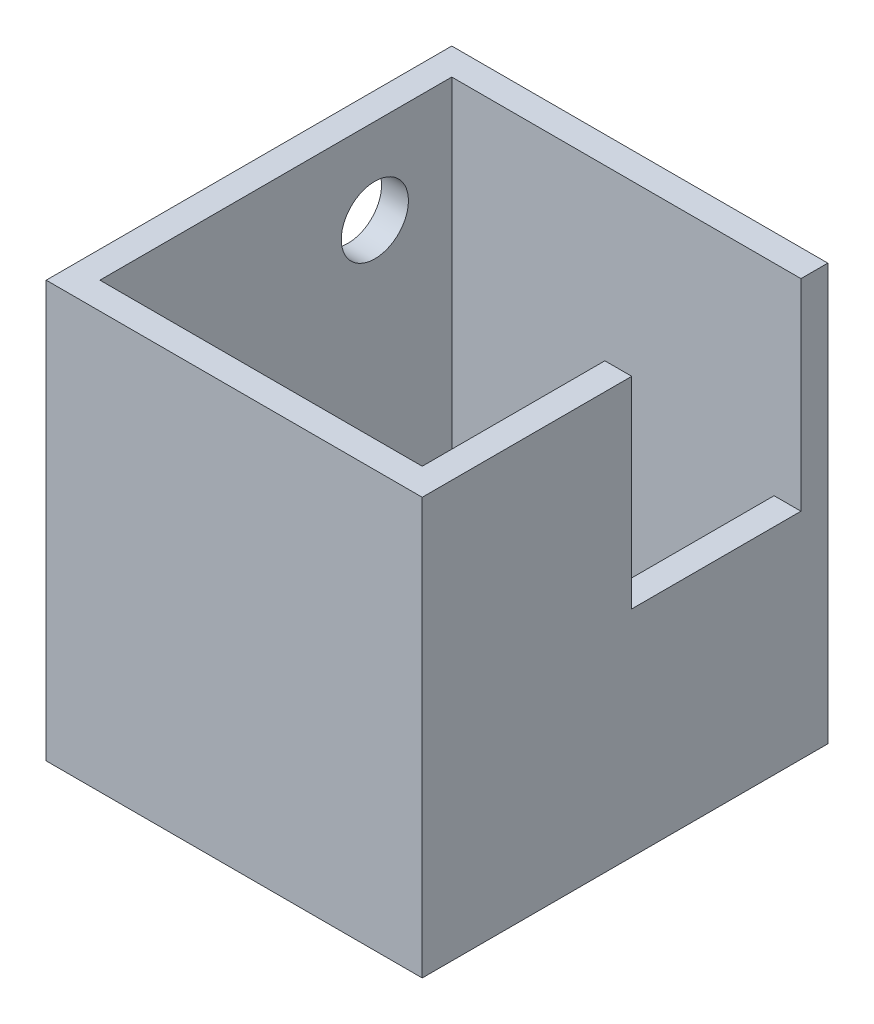
ISO-10303-21;
HEADER;
FILE_DESCRIPTION(('STEP AP214'),'2;1');
FILE_NAME('part.step','',(''),(''),'','','');
FILE_SCHEMA(('AUTOMOTIVE_DESIGN { 1 0 10303 214 1 1 1 1 }'));
ENDSEC;
DATA;
#1=APPLICATION_CONTEXT('core data for automotive mechanical design processes');
#2=APPLICATION_PROTOCOL_DEFINITION('international standard','automotive_design',2000,#1);
#3=PRODUCT_CONTEXT('',#1,'mechanical');
#4=PRODUCT('Part','Part','',(#3));
#5=PRODUCT_RELATED_PRODUCT_CATEGORY('part','',(#4));
#6=PRODUCT_DEFINITION_FORMATION('','',#4);
#7=PRODUCT_DEFINITION_CONTEXT('part definition',#1,'design');
#8=PRODUCT_DEFINITION('design','',#6,#7);
#9=PRODUCT_DEFINITION_SHAPE('','',#8);
#10=(LENGTH_UNIT() NAMED_UNIT(*) SI_UNIT(.MILLI.,.METRE.));
#11=(NAMED_UNIT(*) PLANE_ANGLE_UNIT() SI_UNIT($,.RADIAN.));
#12=(NAMED_UNIT(*) SI_UNIT($,.STERADIAN.) SOLID_ANGLE_UNIT());
#13=UNCERTAINTY_MEASURE_WITH_UNIT(LENGTH_MEASURE(1.E-05),#10,'distance_accuracy_value','');
#14=(GEOMETRIC_REPRESENTATION_CONTEXT(3) GLOBAL_UNCERTAINTY_ASSIGNED_CONTEXT((#13)) GLOBAL_UNIT_ASSIGNED_CONTEXT((#10,
#11,#12)) REPRESENTATION_CONTEXT('',''));
#15=CARTESIAN_POINT('',(0.,0.,0.));
#16=DIRECTION('',(0.,0.,1.));
#17=DIRECTION('',(1.,0.,0.));
#18=AXIS2_PLACEMENT_3D('',#15,#16,#17);
#19=CARTESIAN_POINT('',(2.,0.,30.2));
#20=DIRECTION('',(1.,0.,0.));
#21=DIRECTION('',(0.,0.,-1.));
#22=AXIS2_PLACEMENT_3D('',#19,#20,#21);
#23=PLANE('',#22);
#24=CARTESIAN_POINT('',(2.,24.64,7.72826581115035));
#25=DIRECTION('',(1.,0.,0.));
#26=DIRECTION('',(0.,0.,-1.));
#27=AXIS2_PLACEMENT_3D('',#24,#25,#26);
#28=CIRCLE('',#27,2.5);
#29=CARTESIAN_POINT('',(2.,24.64,5.22826581115035));
#30=VERTEX_POINT('',#29);
#31=EDGE_CURVE('E323',#30,#30,#28,.F.);
#32=ORIENTED_EDGE('',*,*,#31,.T.);
#33=EDGE_LOOP('',(#32));
#34=FACE_BOUND('',#33,.T.);
#35=DIRECTION('',(0.,0.,-1.));
#36=VECTOR('',#35,1.);
#37=CARTESIAN_POINT('',(2.,2.,30.2));
#38=LINE('',#37,#36);
#39=CARTESIAN_POINT('',(2.,2.,15.6));
#40=VERTEX_POINT('',#39);
#41=CARTESIAN_POINT('',(2.,2.,14.6));
#42=VERTEX_POINT('',#41);
#43=EDGE_CURVE('E223',#40,#42,#38,.T.);
#44=ORIENTED_EDGE('',*,*,#43,.T.);
#45=DIRECTION('',(0.,-1.,0.));
#46=VECTOR('',#45,1.);
#47=CARTESIAN_POINT('',(2.,3.5,14.6));
#48=LINE('',#47,#46);
#49=CARTESIAN_POINT('',(2.,3.5,14.6));
#50=VERTEX_POINT('',#49);
#51=EDGE_CURVE('E52',#50,#42,#48,.T.);
#52=ORIENTED_EDGE('',*,*,#51,.F.);
#53=DIRECTION('',(0.,0.,1.));
#54=VECTOR('',#53,1.);
#55=CARTESIAN_POINT('',(2.,3.5,14.6));
#56=LINE('',#55,#54);
#57=CARTESIAN_POINT('',(2.,3.5,2.));
#58=VERTEX_POINT('',#57);
#59=EDGE_CURVE('E164',#58,#50,#56,.T.);
#60=ORIENTED_EDGE('',*,*,#59,.F.);
#61=DIRECTION('',(0.,-1.,0.));
#62=VECTOR('',#61,1.);
#63=CARTESIAN_POINT('',(2.,0.,2.));
#64=LINE('',#63,#62);
#65=CARTESIAN_POINT('',(2.,31.,2.));
#66=VERTEX_POINT('',#65);
#67=EDGE_CURVE('E152',#66,#58,#64,.T.);
#68=ORIENTED_EDGE('',*,*,#67,.F.);
#69=DIRECTION('',(0.,0.,-1.));
#70=VECTOR('',#69,1.);
#71=CARTESIAN_POINT('',(2.,31.,30.2));
#72=LINE('',#71,#70);
#73=CARTESIAN_POINT('',(2.,31.,28.2));
#74=VERTEX_POINT('',#73);
#75=EDGE_CURVE('E238',#74,#66,#72,.T.);
#76=ORIENTED_EDGE('',*,*,#75,.F.);
#77=DIRECTION('',(0.,-1.,0.));
#78=VECTOR('',#77,1.);
#79=CARTESIAN_POINT('',(2.,0.,28.2));
#80=LINE('',#79,#78);
#81=CARTESIAN_POINT('',(2.,0.,28.2));
#82=VERTEX_POINT('',#81);
#83=EDGE_CURVE('E227',#74,#82,#80,.T.);
#84=ORIENTED_EDGE('',*,*,#83,.T.);
#85=DIRECTION('',(0.,0.,-1.));
#86=VECTOR('',#85,1.);
#87=CARTESIAN_POINT('',(2.,0.,28.2));
#88=LINE('',#87,#86);
#89=CARTESIAN_POINT('',(2.,0.,15.6));
#90=VERTEX_POINT('',#89);
#91=EDGE_CURVE('E186',#82,#90,#88,.T.);
#92=ORIENTED_EDGE('',*,*,#91,.T.);
#93=DIRECTION('',(0.,1.,0.));
#94=VECTOR('',#93,1.);
#95=CARTESIAN_POINT('',(2.,-0.00100000000000013,15.6));
#96=LINE('',#95,#94);
#97=EDGE_CURVE('E195',#90,#40,#96,.T.);
#98=ORIENTED_EDGE('',*,*,#97,.T.);
#99=EDGE_LOOP('',(#44,#52,#60,#68,#76,#84,#92,#98));
#100=FACE_BOUND('',#99,.T.);
#101=ADVANCED_FACE('F37',(#34,#100),#23,.T.);
#102=CARTESIAN_POINT('',(0.,2.,30.2));
#103=DIRECTION('',(0.,1.,0.));
#104=DIRECTION('',(0.,0.,1.));
#105=AXIS2_PLACEMENT_3D('',#102,#103,#104);
#106=PLANE('',#105);
#107=DIRECTION('',(0.,0.,-1.));
#108=VECTOR('',#107,1.);
#109=CARTESIAN_POINT('',(26.,2.,30.2));
#110=LINE('',#109,#108);
#111=CARTESIAN_POINT('',(26.,2.,28.2));
#112=VERTEX_POINT('',#111);
#113=CARTESIAN_POINT('',(26.,2.,14.6));
#114=VERTEX_POINT('',#113);
#115=EDGE_CURVE('E226',#112,#114,#110,.T.);
#116=ORIENTED_EDGE('',*,*,#115,.T.);
#117=DIRECTION('',(1.,0.,0.));
#118=VECTOR('',#117,1.);
#119=CARTESIAN_POINT('',(2.,2.,14.6));
#120=LINE('',#119,#118);
#121=EDGE_CURVE('E60',#42,#114,#120,.T.);
#122=ORIENTED_EDGE('',*,*,#121,.F.);
#123=ORIENTED_EDGE('',*,*,#43,.F.);
#124=DIRECTION('',(-1.,0.,0.));
#125=VECTOR('',#124,1.);
#126=CARTESIAN_POINT('',(2.,2.,15.6));
#127=LINE('',#126,#125);
#128=CARTESIAN_POINT('',(17.,2.,15.6));
#129=VERTEX_POINT('',#128);
#130=EDGE_CURVE('E191',#129,#40,#127,.T.);
#131=ORIENTED_EDGE('',*,*,#130,.F.);
#132=DIRECTION('',(0.,0.,-1.));
#133=VECTOR('',#132,1.);
#134=CARTESIAN_POINT('',(17.,2.,28.2));
#135=LINE('',#134,#133);
#136=CARTESIAN_POINT('',(17.,2.,28.2));
#137=VERTEX_POINT('',#136);
#138=EDGE_CURVE('E189',#137,#129,#135,.T.);
#139=ORIENTED_EDGE('',*,*,#138,.F.);
#140=DIRECTION('',(1.,0.,0.));
#141=VECTOR('',#140,1.);
#142=CARTESIAN_POINT('',(0.,2.,28.2));
#143=LINE('',#142,#141);
#144=EDGE_CURVE('E229',#137,#112,#143,.T.);
#145=ORIENTED_EDGE('',*,*,#144,.T.);
#146=EDGE_LOOP('',(#116,#122,#123,#131,#139,#145));
#147=FACE_BOUND('',#146,.T.);
#148=ADVANCED_FACE('F318',(#147),#106,.T.);
#149=CARTESIAN_POINT('',(26.,0.,30.2));
#150=DIRECTION('',(-1.,0.,0.));
#151=DIRECTION('',(0.,0.,1.));
#152=AXIS2_PLACEMENT_3D('',#149,#150,#151);
#153=PLANE('',#152);
#154=DIRECTION('',(0.,0.,-1.));
#155=VECTOR('',#154,1.);
#156=CARTESIAN_POINT('',(26.,3.5,14.6));
#157=LINE('',#156,#155);
#158=CARTESIAN_POINT('',(26.,3.5,14.6));
#159=VERTEX_POINT('',#158);
#160=CARTESIAN_POINT('',(26.,3.5,2.));
#161=VERTEX_POINT('',#160);
#162=EDGE_CURVE('E171',#159,#161,#157,.T.);
#163=ORIENTED_EDGE('',*,*,#162,.F.);
#164=DIRECTION('',(0.,-1.,0.));
#165=VECTOR('',#164,1.);
#166=CARTESIAN_POINT('',(26.,3.5,14.6));
#167=LINE('',#166,#165);
#168=EDGE_CURVE('E172',#159,#114,#167,.T.);
#169=ORIENTED_EDGE('',*,*,#168,.T.);
#170=ORIENTED_EDGE('',*,*,#115,.F.);
#171=DIRECTION('',(0.,1.,0.));
#172=VECTOR('',#171,1.);
#173=CARTESIAN_POINT('',(26.,0.,28.2));
#174=LINE('',#173,#172);
#175=CARTESIAN_POINT('',(26.,31.,28.2));
#176=VERTEX_POINT('',#175);
#177=EDGE_CURVE('E233',#112,#176,#174,.T.);
#178=ORIENTED_EDGE('',*,*,#177,.T.);
#179=DIRECTION('',(0.,0.,-1.));
#180=VECTOR('',#179,1.);
#181=CARTESIAN_POINT('',(26.,31.,30.2));
#182=LINE('',#181,#180);
#183=CARTESIAN_POINT('',(26.,31.,14.6));
#184=VERTEX_POINT('',#183);
#185=EDGE_CURVE('E231',#176,#184,#182,.T.);
#186=ORIENTED_EDGE('',*,*,#185,.T.);
#187=DIRECTION('',(0.,-1.,0.));
#188=VECTOR('',#187,1.);
#189=CARTESIAN_POINT('',(26.,31.,14.6));
#190=LINE('',#189,#188);
#191=CARTESIAN_POINT('',(26.,16.,14.6));
#192=VERTEX_POINT('',#191);
#193=EDGE_CURVE('E204',#184,#192,#190,.T.);
#194=ORIENTED_EDGE('',*,*,#193,.T.);
#195=DIRECTION('',(0.,0.,-1.));
#196=VECTOR('',#195,1.);
#197=CARTESIAN_POINT('',(26.,16.,2.));
#198=LINE('',#197,#196);
#199=CARTESIAN_POINT('',(26.,16.,2.));
#200=VERTEX_POINT('',#199);
#201=EDGE_CURVE('E207',#192,#200,#198,.T.);
#202=ORIENTED_EDGE('',*,*,#201,.T.);
#203=DIRECTION('',(0.,1.,0.));
#204=VECTOR('',#203,1.);
#205=CARTESIAN_POINT('',(26.,0.,2.));
#206=LINE('',#205,#204);
#207=EDGE_CURVE('E160',#161,#200,#206,.T.);
#208=ORIENTED_EDGE('',*,*,#207,.F.);
#209=EDGE_LOOP('',(#163,#169,#170,#178,#186,#194,#202,#208));
#210=FACE_BOUND('',#209,.T.);
#211=ADVANCED_FACE('F300',(#210),#153,.T.);
#212=CARTESIAN_POINT('',(0.,0.,2.));
#213=DIRECTION('',(0.,0.,-1.));
#214=DIRECTION('',(-1.,0.,0.));
#215=AXIS2_PLACEMENT_3D('',#212,#213,#214);
#216=PLANE('',#215);
#217=DIRECTION('',(-1.,0.,0.));
#218=VECTOR('',#217,1.);
#219=CARTESIAN_POINT('',(2.,3.5,2.));
#220=LINE('',#219,#218);
#221=EDGE_CURVE('E155',#161,#58,#220,.T.);
#222=ORIENTED_EDGE('',*,*,#221,.F.);
#223=ORIENTED_EDGE('',*,*,#207,.T.);
#224=DIRECTION('',(1.,0.,0.));
#225=VECTOR('',#224,1.);
#226=CARTESIAN_POINT('',(-0.001000000000001,16.,2.));
#227=LINE('',#226,#225);
#228=CARTESIAN_POINT('',(28.,16.,2.));
#229=VERTEX_POINT('',#228);
#230=EDGE_CURVE('E161',#200,#229,#227,.T.);
#231=ORIENTED_EDGE('',*,*,#230,.T.);
#232=DIRECTION('',(0.,1.,0.));
#233=VECTOR('',#232,1.);
#234=CARTESIAN_POINT('',(28.,31.,2.));
#235=LINE('',#234,#233);
#236=CARTESIAN_POINT('',(28.,31.,2.));
#237=VERTEX_POINT('',#236);
#238=EDGE_CURVE('E210',#229,#237,#235,.T.);
#239=ORIENTED_EDGE('',*,*,#238,.T.);
#240=DIRECTION('',(-1.,0.,0.));
#241=VECTOR('',#240,1.);
#242=CARTESIAN_POINT('',(0.,31.,2.));
#243=LINE('',#242,#241);
#244=EDGE_CURVE('E158',#237,#66,#243,.T.);
#245=ORIENTED_EDGE('',*,*,#244,.T.);
#246=ORIENTED_EDGE('',*,*,#67,.T.);
#247=EDGE_LOOP('',(#222,#223,#231,#239,#245,#246));
#248=FACE_BOUND('',#247,.T.);
#249=ADVANCED_FACE('F153',(#248),#216,.F.);
#250=CARTESIAN_POINT('',(0.,31.,30.2));
#251=DIRECTION('',(0.,-1.,0.));
#252=DIRECTION('',(0.,0.,-1.));
#253=AXIS2_PLACEMENT_3D('',#250,#251,#252);
#254=PLANE('',#253);
#255=DIRECTION('',(0.,0.,-1.));
#256=VECTOR('',#255,1.);
#257=CARTESIAN_POINT('',(28.,31.,30.2));
#258=LINE('',#257,#256);
#259=CARTESIAN_POINT('',(28.,31.,30.2));
#260=VERTEX_POINT('',#259);
#261=CARTESIAN_POINT('',(28.,31.,14.6));
#262=VERTEX_POINT('',#261);
#263=EDGE_CURVE('E267',#260,#262,#258,.T.);
#264=ORIENTED_EDGE('',*,*,#263,.T.);
#265=DIRECTION('',(1.,0.,0.));
#266=VECTOR('',#265,1.);
#267=CARTESIAN_POINT('',(-0.001000000000001,31.,14.6));
#268=LINE('',#267,#266);
#269=EDGE_CURVE('E218',#184,#262,#268,.T.);
#270=ORIENTED_EDGE('',*,*,#269,.F.);
#271=ORIENTED_EDGE('',*,*,#185,.F.);
#272=DIRECTION('',(-1.,0.,0.));
#273=VECTOR('',#272,1.);
#274=CARTESIAN_POINT('',(0.,31.,28.2));
#275=LINE('',#274,#273);
#276=EDGE_CURVE('E237',#176,#74,#275,.T.);
#277=ORIENTED_EDGE('',*,*,#276,.T.);
#278=ORIENTED_EDGE('',*,*,#75,.T.);
#279=ORIENTED_EDGE('',*,*,#244,.F.);
#280=CARTESIAN_POINT('',(28.,31.,0.));
#281=VERTEX_POINT('',#280);
#282=EDGE_CURVE('E266',#237,#281,#258,.T.);
#283=ORIENTED_EDGE('',*,*,#282,.T.);
#284=DIRECTION('',(-1.,0.,0.));
#285=VECTOR('',#284,1.);
#286=CARTESIAN_POINT('',(0.,31.,0.));
#287=LINE('',#286,#285);
#288=CARTESIAN_POINT('',(0.,31.,0.));
#289=VERTEX_POINT('',#288);
#290=EDGE_CURVE('E249',#281,#289,#287,.T.);
#291=ORIENTED_EDGE('',*,*,#290,.T.);
#292=DIRECTION('',(0.,0.,-1.));
#293=VECTOR('',#292,1.);
#294=CARTESIAN_POINT('',(0.,31.,30.2));
#295=LINE('',#294,#293);
#296=CARTESIAN_POINT('',(0.,31.,30.2));
#297=VERTEX_POINT('',#296);
#298=EDGE_CURVE('E255',#297,#289,#295,.T.);
#299=ORIENTED_EDGE('',*,*,#298,.F.);
#300=DIRECTION('',(-1.,0.,0.));
#301=VECTOR('',#300,1.);
#302=CARTESIAN_POINT('',(0.,31.,30.2));
#303=LINE('',#302,#301);
#304=EDGE_CURVE('E253',#260,#297,#303,.T.);
#305=ORIENTED_EDGE('',*,*,#304,.F.);
#306=EDGE_LOOP('',(#264,#270,#271,#277,#278,#279,#283,#291,#299,#305));
#307=FACE_BOUND('',#306,.T.);
#308=ADVANCED_FACE('F285',(#307),#254,.F.);
#309=CARTESIAN_POINT('',(0.,0.,30.2));
#310=DIRECTION('',(1.,0.,0.));
#311=DIRECTION('',(0.,0.,-1.));
#312=AXIS2_PLACEMENT_3D('',#309,#310,#311);
#313=PLANE('',#312);
#314=CARTESIAN_POINT('',(0.,24.64,7.72826581115035));
#315=DIRECTION('',(-1.,0.,0.));
#316=DIRECTION('',(0.,0.,1.));
#317=AXIS2_PLACEMENT_3D('',#314,#315,#316);
#318=CIRCLE('',#317,2.5);
#319=CARTESIAN_POINT('',(0.,24.64,10.2282658111504));
#320=VERTEX_POINT('',#319);
#321=EDGE_CURVE('E178',#320,#320,#318,.T.);
#322=ORIENTED_EDGE('',*,*,#321,.F.);
#323=EDGE_LOOP('',(#322));
#324=FACE_BOUND('',#323,.T.);
#325=DIRECTION('',(0.,-1.,0.));
#326=VECTOR('',#325,1.);
#327=CARTESIAN_POINT('',(0.,0.,0.));
#328=LINE('',#327,#326);
#329=CARTESIAN_POINT('',(0.,0.,0.));
#330=VERTEX_POINT('',#329);
#331=EDGE_CURVE('E225',#289,#330,#328,.T.);
#332=ORIENTED_EDGE('',*,*,#331,.T.);
#333=DIRECTION('',(0.,0.,-1.));
#334=VECTOR('',#333,1.);
#335=CARTESIAN_POINT('',(0.,0.,30.2));
#336=LINE('',#335,#334);
#337=CARTESIAN_POINT('',(0.,0.,30.2));
#338=VERTEX_POINT('',#337);
#339=EDGE_CURVE('E11',#338,#330,#336,.T.);
#340=ORIENTED_EDGE('',*,*,#339,.F.);
#341=DIRECTION('',(0.,-1.,0.));
#342=VECTOR('',#341,1.);
#343=CARTESIAN_POINT('',(0.,0.,30.2));
#344=LINE('',#343,#342);
#345=EDGE_CURVE('E245',#297,#338,#344,.T.);
#346=ORIENTED_EDGE('',*,*,#345,.F.);
#347=ORIENTED_EDGE('',*,*,#298,.T.);
#348=EDGE_LOOP('',(#332,#340,#346,#347));
#349=FACE_BOUND('',#348,.T.);
#350=ADVANCED_FACE('F39',(#324,#349),#313,.F.);
#351=CARTESIAN_POINT('',(0.,0.,30.2));
#352=DIRECTION('',(0.,1.,0.));
#353=DIRECTION('',(0.,0.,1.));
#354=AXIS2_PLACEMENT_3D('',#351,#352,#353);
#355=PLANE('',#354);
#356=DIRECTION('',(1.,0.,0.));
#357=VECTOR('',#356,1.);
#358=CARTESIAN_POINT('',(2.,0.,15.6));
#359=LINE('',#358,#357);
#360=CARTESIAN_POINT('',(17.,0.,15.6));
#361=VERTEX_POINT('',#360);
#362=EDGE_CURVE('E183',#90,#361,#359,.T.);
#363=ORIENTED_EDGE('',*,*,#362,.F.);
#364=ORIENTED_EDGE('',*,*,#91,.F.);
#365=DIRECTION('',(-1.,0.,0.));
#366=VECTOR('',#365,1.);
#367=CARTESIAN_POINT('',(2.,0.,28.2));
#368=LINE('',#367,#366);
#369=CARTESIAN_POINT('',(17.,0.,28.2));
#370=VERTEX_POINT('',#369);
#371=EDGE_CURVE('E197',#370,#82,#368,.T.);
#372=ORIENTED_EDGE('',*,*,#371,.F.);
#373=DIRECTION('',(0.,0.,1.));
#374=VECTOR('',#373,1.);
#375=CARTESIAN_POINT('',(17.,0.,28.2));
#376=LINE('',#375,#374);
#377=EDGE_CURVE('E181',#361,#370,#376,.T.);
#378=ORIENTED_EDGE('',*,*,#377,.F.);
#379=EDGE_LOOP('',(#363,#364,#372,#378));
#380=FACE_BOUND('',#379,.T.);
#381=DIRECTION('',(1.,0.,0.));
#382=VECTOR('',#381,1.);
#383=CARTESIAN_POINT('',(0.,0.,0.));
#384=LINE('',#383,#382);
#385=CARTESIAN_POINT('',(28.,0.,0.));
#386=VERTEX_POINT('',#385);
#387=EDGE_CURVE('E258',#330,#386,#384,.T.);
#388=ORIENTED_EDGE('',*,*,#387,.T.);
#389=DIRECTION('',(0.,0.,-1.));
#390=VECTOR('',#389,1.);
#391=CARTESIAN_POINT('',(28.,0.,30.2));
#392=LINE('',#391,#390);
#393=CARTESIAN_POINT('',(28.,0.,30.2));
#394=VERTEX_POINT('',#393);
#395=EDGE_CURVE('E45',#394,#386,#392,.T.);
#396=ORIENTED_EDGE('',*,*,#395,.F.);
#397=DIRECTION('',(1.,0.,0.));
#398=VECTOR('',#397,1.);
#399=CARTESIAN_POINT('',(0.,0.,30.2));
#400=LINE('',#399,#398);
#401=EDGE_CURVE('E248',#338,#394,#400,.T.);
#402=ORIENTED_EDGE('',*,*,#401,.F.);
#403=ORIENTED_EDGE('',*,*,#339,.T.);
#404=EDGE_LOOP('',(#388,#396,#402,#403));
#405=FACE_BOUND('',#404,.T.);
#406=ADVANCED_FACE('F313',(#380,#405),#355,.F.);
#407=CARTESIAN_POINT('',(28.,0.,30.2));
#408=DIRECTION('',(-1.,0.,0.));
#409=DIRECTION('',(0.,0.,1.));
#410=AXIS2_PLACEMENT_3D('',#407,#408,#409);
#411=PLANE('',#410);
#412=DIRECTION('',(0.,0.,-1.));
#413=VECTOR('',#412,1.);
#414=CARTESIAN_POINT('',(28.,16.,2.));
#415=LINE('',#414,#413);
#416=CARTESIAN_POINT('',(28.,16.,14.6));
#417=VERTEX_POINT('',#416);
#418=EDGE_CURVE('E215',#417,#229,#415,.T.);
#419=ORIENTED_EDGE('',*,*,#418,.F.);
#420=DIRECTION('',(0.,-1.,0.));
#421=VECTOR('',#420,1.);
#422=CARTESIAN_POINT('',(28.,31.,14.6));
#423=LINE('',#422,#421);
#424=EDGE_CURVE('E212',#262,#417,#423,.T.);
#425=ORIENTED_EDGE('',*,*,#424,.F.);
#426=ORIENTED_EDGE('',*,*,#263,.F.);
#427=DIRECTION('',(0.,1.,0.));
#428=VECTOR('',#427,1.);
#429=CARTESIAN_POINT('',(28.,0.,30.2));
#430=LINE('',#429,#428);
#431=EDGE_CURVE('E251',#394,#260,#430,.T.);
#432=ORIENTED_EDGE('',*,*,#431,.F.);
#433=ORIENTED_EDGE('',*,*,#395,.T.);
#434=DIRECTION('',(0.,1.,0.));
#435=VECTOR('',#434,1.);
#436=CARTESIAN_POINT('',(28.,0.,0.));
#437=LINE('',#436,#435);
#438=EDGE_CURVE('E260',#386,#281,#437,.T.);
#439=ORIENTED_EDGE('',*,*,#438,.T.);
#440=ORIENTED_EDGE('',*,*,#282,.F.);
#441=ORIENTED_EDGE('',*,*,#238,.F.);
#442=EDGE_LOOP('',(#419,#425,#426,#432,#433,#439,#440,#441));
#443=FACE_BOUND('',#442,.T.);
#444=ADVANCED_FACE('F275',(#443),#411,.F.);
#445=CARTESIAN_POINT('',(0.,0.,30.2));
#446=DIRECTION('',(0.,0.,-1.));
#447=DIRECTION('',(-1.,0.,0.));
#448=AXIS2_PLACEMENT_3D('',#445,#446,#447);
#449=PLANE('',#448);
#450=ORIENTED_EDGE('',*,*,#345,.T.);
#451=ORIENTED_EDGE('',*,*,#401,.T.);
#452=ORIENTED_EDGE('',*,*,#431,.T.);
#453=ORIENTED_EDGE('',*,*,#304,.T.);
#454=EDGE_LOOP('',(#450,#451,#452,#453));
#455=FACE_BOUND('',#454,.T.);
#456=ADVANCED_FACE('F291',(#455),#449,.F.);
#457=CARTESIAN_POINT('',(0.,0.,0.));
#458=DIRECTION('',(0.,0.,-1.));
#459=DIRECTION('',(-1.,0.,0.));
#460=AXIS2_PLACEMENT_3D('',#457,#458,#459);
#461=PLANE('',#460);
#462=ORIENTED_EDGE('',*,*,#331,.F.);
#463=ORIENTED_EDGE('',*,*,#290,.F.);
#464=ORIENTED_EDGE('',*,*,#438,.F.);
#465=ORIENTED_EDGE('',*,*,#387,.F.);
#466=EDGE_LOOP('',(#462,#463,#464,#465));
#467=FACE_BOUND('',#466,.T.);
#468=ADVANCED_FACE('F282',(#467),#461,.T.);
#469=CARTESIAN_POINT('',(0.,0.,28.2));
#470=DIRECTION('',(0.,0.,-1.));
#471=DIRECTION('',(-1.,0.,0.));
#472=AXIS2_PLACEMENT_3D('',#469,#470,#471);
#473=PLANE('',#472);
#474=ORIENTED_EDGE('',*,*,#83,.F.);
#475=ORIENTED_EDGE('',*,*,#276,.F.);
#476=ORIENTED_EDGE('',*,*,#177,.F.);
#477=ORIENTED_EDGE('',*,*,#144,.F.);
#478=DIRECTION('',(0.,1.,0.));
#479=VECTOR('',#478,1.);
#480=CARTESIAN_POINT('',(17.,-0.00100000000000013,28.2));
#481=LINE('',#480,#479);
#482=EDGE_CURVE('E194',#370,#137,#481,.T.);
#483=ORIENTED_EDGE('',*,*,#482,.F.);
#484=ORIENTED_EDGE('',*,*,#371,.T.);
#485=EDGE_LOOP('',(#474,#475,#476,#477,#483,#484));
#486=FACE_BOUND('',#485,.T.);
#487=ADVANCED_FACE('F305',(#486),#473,.T.);
#488=CARTESIAN_POINT('',(-0.001000000000001,31.,14.6));
#489=DIRECTION('',(0.,0.,1.));
#490=DIRECTION('',(0.,-1.,0.));
#491=AXIS2_PLACEMENT_3D('',#488,#489,#490);
#492=PLANE('',#491);
#493=ORIENTED_EDGE('',*,*,#269,.T.);
#494=ORIENTED_EDGE('',*,*,#424,.T.);
#495=DIRECTION('',(1.,0.,0.));
#496=VECTOR('',#495,1.);
#497=CARTESIAN_POINT('',(-0.001000000000001,16.,14.6));
#498=LINE('',#497,#496);
#499=EDGE_CURVE('E220',#192,#417,#498,.T.);
#500=ORIENTED_EDGE('',*,*,#499,.F.);
#501=ORIENTED_EDGE('',*,*,#193,.F.);
#502=EDGE_LOOP('',(#493,#494,#500,#501));
#503=FACE_BOUND('',#502,.T.);
#504=ADVANCED_FACE('F298',(#503),#492,.F.);
#505=CARTESIAN_POINT('',(-0.001000000000001,16.,2.));
#506=DIRECTION('',(0.,-1.,0.));
#507=DIRECTION('',(0.,0.,-1.));
#508=AXIS2_PLACEMENT_3D('',#505,#506,#507);
#509=PLANE('',#508);
#510=ORIENTED_EDGE('',*,*,#499,.T.);
#511=ORIENTED_EDGE('',*,*,#418,.T.);
#512=ORIENTED_EDGE('',*,*,#230,.F.);
#513=ORIENTED_EDGE('',*,*,#201,.F.);
#514=EDGE_LOOP('',(#510,#511,#512,#513));
#515=FACE_BOUND('',#514,.T.);
#516=ADVANCED_FACE('F382',(#515),#509,.F.);
#517=CARTESIAN_POINT('',(2.,-0.00100000000000013,15.6));
#518=DIRECTION('',(0.,0.,-1.));
#519=DIRECTION('',(-1.,0.,0.));
#520=AXIS2_PLACEMENT_3D('',#517,#518,#519);
#521=PLANE('',#520);
#522=ORIENTED_EDGE('',*,*,#362,.T.);
#523=DIRECTION('',(0.,1.,0.));
#524=VECTOR('',#523,1.);
#525=CARTESIAN_POINT('',(17.,-0.00100000000000013,15.6));
#526=LINE('',#525,#524);
#527=EDGE_CURVE('E198',#361,#129,#526,.T.);
#528=ORIENTED_EDGE('',*,*,#527,.T.);
#529=ORIENTED_EDGE('',*,*,#130,.T.);
#530=ORIENTED_EDGE('',*,*,#97,.F.);
#531=EDGE_LOOP('',(#522,#528,#529,#530));
#532=FACE_BOUND('',#531,.T.);
#533=ADVANCED_FACE('F315',(#532),#521,.F.);
#534=CARTESIAN_POINT('',(17.,-0.00100000000000013,28.2));
#535=DIRECTION('',(1.,0.,0.));
#536=DIRECTION('',(0.,0.,-1.));
#537=AXIS2_PLACEMENT_3D('',#534,#535,#536);
#538=PLANE('',#537);
#539=ORIENTED_EDGE('',*,*,#377,.T.);
#540=ORIENTED_EDGE('',*,*,#482,.T.);
#541=ORIENTED_EDGE('',*,*,#138,.T.);
#542=ORIENTED_EDGE('',*,*,#527,.F.);
#543=EDGE_LOOP('',(#539,#540,#541,#542));
#544=FACE_BOUND('',#543,.T.);
#545=ADVANCED_FACE('F393',(#544),#538,.F.);
#546=CARTESIAN_POINT('',(2.,3.5,14.6));
#547=DIRECTION('',(0.,0.,-1.));
#548=DIRECTION('',(-1.,0.,0.));
#549=AXIS2_PLACEMENT_3D('',#546,#547,#548);
#550=PLANE('',#549);
#551=ORIENTED_EDGE('',*,*,#121,.T.);
#552=ORIENTED_EDGE('',*,*,#168,.F.);
#553=DIRECTION('',(1.,0.,0.));
#554=VECTOR('',#553,1.);
#555=CARTESIAN_POINT('',(2.,3.5,14.6));
#556=LINE('',#555,#554);
#557=EDGE_CURVE('E167',#50,#159,#556,.T.);
#558=ORIENTED_EDGE('',*,*,#557,.F.);
#559=ORIENTED_EDGE('',*,*,#51,.T.);
#560=EDGE_LOOP('',(#551,#552,#558,#559));
#561=FACE_BOUND('',#560,.T.);
#562=ADVANCED_FACE('F320',(#561),#550,.F.);
#563=CARTESIAN_POINT('',(0.,3.5,0.));
#564=DIRECTION('',(0.,-1.,0.));
#565=DIRECTION('',(0.,0.,-1.));
#566=AXIS2_PLACEMENT_3D('',#563,#564,#565);
#567=PLANE('',#566);
#568=ORIENTED_EDGE('',*,*,#59,.T.);
#569=ORIENTED_EDGE('',*,*,#557,.T.);
#570=ORIENTED_EDGE('',*,*,#162,.T.);
#571=ORIENTED_EDGE('',*,*,#221,.T.);
#572=EDGE_LOOP('',(#568,#569,#570,#571));
#573=FACE_BOUND('',#572,.T.);
#574=ADVANCED_FACE('F170',(#573),#567,.F.);
#575=CARTESIAN_POINT('',(28.001,24.64,7.72826581115035));
#576=DIRECTION('',(-1.,0.,0.));
#577=DIRECTION('',(0.,0.,1.));
#578=AXIS2_PLACEMENT_3D('',#575,#576,#577);
#579=CYLINDRICAL_SURFACE('',#578,2.5);
#580=ORIENTED_EDGE('',*,*,#31,.F.);
#581=EDGE_LOOP('',(#580));
#582=FACE_BOUND('',#581,.T.);
#583=ORIENTED_EDGE('',*,*,#321,.T.);
#584=EDGE_LOOP('',(#583));
#585=FACE_BOUND('',#584,.T.);
#586=ADVANCED_FACE('F329',(#582,#585),#579,.F.);
#587=CLOSED_SHELL('',(#101,#148,#211,#249,#308,#350,#406,#444,#456,#468,#487,#504,#516,#533,
#545,#562,#574,#586));
#588=MANIFOLD_SOLID_BREP('B2',#587);
#589=ADVANCED_BREP_SHAPE_REPRESENTATION('',(#18,#588),#14);
#590=SHAPE_DEFINITION_REPRESENTATION(#9,#589);
ENDSEC;
END-ISO-10303-21;
